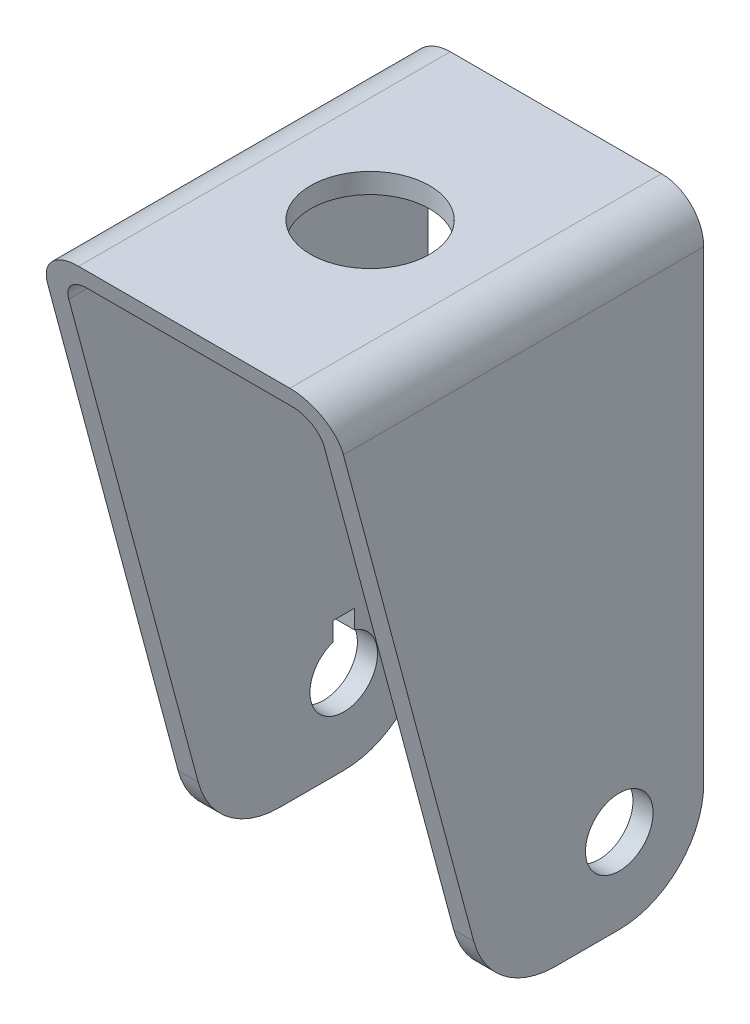
ISO-10303-21;
HEADER;
FILE_DESCRIPTION(('STEP AP214'),'2;1');
FILE_NAME('part.step','',(''),(''),'','','');
FILE_SCHEMA(('AUTOMOTIVE_DESIGN { 1 0 10303 214 1 1 1 1 }'));
ENDSEC;
DATA;
#1=APPLICATION_CONTEXT('core data for automotive mechanical design processes');
#2=APPLICATION_PROTOCOL_DEFINITION('international standard','automotive_design',2000,#1);
#3=PRODUCT_CONTEXT('',#1,'mechanical');
#4=PRODUCT('Part','Part','',(#3));
#5=PRODUCT_RELATED_PRODUCT_CATEGORY('part','',(#4));
#6=PRODUCT_DEFINITION_FORMATION('','',#4);
#7=PRODUCT_DEFINITION_CONTEXT('part definition',#1,'design');
#8=PRODUCT_DEFINITION('design','',#6,#7);
#9=PRODUCT_DEFINITION_SHAPE('','',#8);
#10=(LENGTH_UNIT() NAMED_UNIT(*) SI_UNIT(.MILLI.,.METRE.));
#11=(NAMED_UNIT(*) PLANE_ANGLE_UNIT() SI_UNIT($,.RADIAN.));
#12=(NAMED_UNIT(*) SI_UNIT($,.STERADIAN.) SOLID_ANGLE_UNIT());
#13=UNCERTAINTY_MEASURE_WITH_UNIT(LENGTH_MEASURE(1.E-05),#10,'distance_accuracy_value','');
#14=(GEOMETRIC_REPRESENTATION_CONTEXT(3) GLOBAL_UNCERTAINTY_ASSIGNED_CONTEXT((#13)) GLOBAL_UNIT_ASSIGNED_CONTEXT((#10,
#11,#12)) REPRESENTATION_CONTEXT('',''));
#15=CARTESIAN_POINT('',(0.,0.,0.));
#16=DIRECTION('',(0.,0.,1.));
#17=DIRECTION('',(1.,0.,0.));
#18=AXIS2_PLACEMENT_3D('',#15,#16,#17);
#19=CARTESIAN_POINT('',(0.,-60.,-4.42971334996849));
#20=DIRECTION('',(1.,0.,0.));
#21=DIRECTION('',(0.,0.,-1.));
#22=AXIS2_PLACEMENT_3D('',#19,#20,#21);
#23=CYLINDRICAL_SURFACE('',#22,10.);
#24=DIRECTION('',(1.,0.,0.));
#25=VECTOR('',#24,1.);
#26=CARTESIAN_POINT('',(0.,-62.5881904510252,5.22954491292219));
#27=LINE('',#26,#25);
#28=CARTESIAN_POINT('',(15.12,-62.5881904510252,5.22954491292219));
#29=VERTEX_POINT('',#28);
#30=CARTESIAN_POINT('',(17.5,-62.5881904510252,5.22954491292219));
#31=VERTEX_POINT('',#30);
#32=EDGE_CURVE('E324',#29,#31,#27,.T.);
#33=ORIENTED_EDGE('',*,*,#32,.F.);
#34=CARTESIAN_POINT('',(15.12,-60.,-4.42971334996849));
#35=DIRECTION('',(1.,0.,0.));
#36=DIRECTION('',(0.,0.,-1.));
#37=AXIS2_PLACEMENT_3D('',#34,#35,#36);
#38=CIRCLE('',#37,10.);
#39=CARTESIAN_POINT('',(15.12,-70.,-4.42971334996849));
#40=VERTEX_POINT('',#39);
#41=EDGE_CURVE('E42',#40,#29,#38,.F.);
#42=ORIENTED_EDGE('',*,*,#41,.F.);
#43=DIRECTION('',(1.,0.,0.));
#44=VECTOR('',#43,1.);
#45=CARTESIAN_POINT('',(17.5,-70.,-4.42971334996849));
#46=LINE('',#45,#44);
#47=CARTESIAN_POINT('',(17.5,-70.,-4.42971334996849));
#48=VERTEX_POINT('',#47);
#49=EDGE_CURVE('E327',#48,#40,#46,.F.);
#50=ORIENTED_EDGE('',*,*,#49,.F.);
#51=CARTESIAN_POINT('',(17.5,-60.,-4.42971334996849));
#52=DIRECTION('',(-1.,0.,0.));
#53=DIRECTION('',(0.,-1.,0.));
#54=AXIS2_PLACEMENT_3D('',#51,#52,#53);
#55=CIRCLE('',#54,10.);
#56=EDGE_CURVE('E11',#31,#48,#55,.F.);
#57=ORIENTED_EDGE('',*,*,#56,.F.);
#58=EDGE_LOOP('',(#33,#42,#50,#57));
#59=FACE_BOUND('',#58,.T.);
#60=ADVANCED_FACE('F35',(#59),#23,.T.);
#61=CARTESIAN_POINT('',(12.5,-60.,-12.));
#62=DIRECTION('',(1.,0.,0.));
#63=DIRECTION('',(0.,0.,-1.));
#64=AXIS2_PLACEMENT_3D('',#61,#62,#63);
#65=CYLINDRICAL_SURFACE('',#64,10.);
#66=DIRECTION('',(-1.,0.,0.));
#67=VECTOR('',#66,1.);
#68=CARTESIAN_POINT('',(12.5,-60.,-22.));
#69=LINE('',#68,#67);
#70=CARTESIAN_POINT('',(17.5,-60.,-22.));
#71=VERTEX_POINT('',#70);
#72=CARTESIAN_POINT('',(15.12,-60.,-22.));
#73=VERTEX_POINT('',#72);
#74=EDGE_CURVE('E313',#71,#73,#69,.T.);
#75=ORIENTED_EDGE('',*,*,#74,.F.);
#76=CARTESIAN_POINT('',(17.5,-60.,-12.));
#77=DIRECTION('',(-1.,0.,0.));
#78=DIRECTION('',(0.,-1.,0.));
#79=AXIS2_PLACEMENT_3D('',#76,#77,#78);
#80=CIRCLE('',#79,10.);
#81=CARTESIAN_POINT('',(17.5,-70.,-12.));
#82=VERTEX_POINT('',#81);
#83=EDGE_CURVE('E319',#82,#71,#80,.F.);
#84=ORIENTED_EDGE('',*,*,#83,.F.);
#85=DIRECTION('',(-1.,0.,0.));
#86=VECTOR('',#85,1.);
#87=CARTESIAN_POINT('',(12.5,-70.,-12.));
#88=LINE('',#87,#86);
#89=CARTESIAN_POINT('',(15.12,-70.,-12.));
#90=VERTEX_POINT('',#89);
#91=EDGE_CURVE('E316',#90,#82,#88,.F.);
#92=ORIENTED_EDGE('',*,*,#91,.F.);
#93=CARTESIAN_POINT('',(15.12,-60.,-12.));
#94=DIRECTION('',(1.,0.,0.));
#95=DIRECTION('',(0.,0.,-1.));
#96=AXIS2_PLACEMENT_3D('',#93,#94,#95);
#97=CIRCLE('',#96,10.);
#98=EDGE_CURVE('E321',#73,#90,#97,.F.);
#99=ORIENTED_EDGE('',*,*,#98,.F.);
#100=EDGE_LOOP('',(#75,#84,#92,#99));
#101=FACE_BOUND('',#100,.T.);
#102=ADVANCED_FACE('F352',(#101),#65,.T.);
#103=CARTESIAN_POINT('',(12.12,-2.38,22.));
#104=DIRECTION('',(0.,1.,0.));
#105=DIRECTION('',(-1.,0.,0.));
#106=AXIS2_PLACEMENT_3D('',#103,#104,#105);
#107=PLANE('',#106);
#108=CARTESIAN_POINT('',(0.,-2.38000000000001,0.));
#109=DIRECTION('',(0.,1.,0.));
#110=DIRECTION('',(-1.,0.,0.));
#111=AXIS2_PLACEMENT_3D('',#108,#109,#110);
#112=CIRCLE('',#111,7.05);
#113=CARTESIAN_POINT('',(-7.05,-2.38000000000001,0.));
#114=VERTEX_POINT('',#113);
#115=EDGE_CURVE('E195',#114,#114,#112,.T.);
#116=ORIENTED_EDGE('',*,*,#115,.T.);
#117=EDGE_LOOP('',(#116));
#118=FACE_BOUND('',#117,.T.);
#119=DIRECTION('',(0.,0.,-1.));
#120=VECTOR('',#119,1.);
#121=CARTESIAN_POINT('',(12.12,-2.38,22.));
#122=LINE('',#121,#120);
#123=CARTESIAN_POINT('',(12.12,-2.38,21.3622809220139));
#124=VERTEX_POINT('',#123);
#125=CARTESIAN_POINT('',(12.12,-2.38,-22.));
#126=VERTEX_POINT('',#125);
#127=EDGE_CURVE('E311',#124,#126,#122,.T.);
#128=ORIENTED_EDGE('',*,*,#127,.F.);
#129=DIRECTION('',(-1.,0.,0.));
#130=VECTOR('',#129,1.);
#131=CARTESIAN_POINT('',(12.12,-2.38,21.3622809220139));
#132=LINE('',#131,#130);
#133=CARTESIAN_POINT('',(-12.12,-2.38,21.3622809220139));
#134=VERTEX_POINT('',#133);
#135=EDGE_CURVE('E280',#124,#134,#132,.T.);
#136=ORIENTED_EDGE('',*,*,#135,.T.);
#137=DIRECTION('',(0.,0.,-1.));
#138=VECTOR('',#137,1.);
#139=CARTESIAN_POINT('',(-12.12,-2.38,22.));
#140=LINE('',#139,#138);
#141=CARTESIAN_POINT('',(-12.12,-2.38,-22.));
#142=VERTEX_POINT('',#141);
#143=EDGE_CURVE('E237',#134,#142,#140,.T.);
#144=ORIENTED_EDGE('',*,*,#143,.T.);
#145=DIRECTION('',(1.,0.,0.));
#146=VECTOR('',#145,1.);
#147=CARTESIAN_POINT('',(12.12,-2.38,-22.));
#148=LINE('',#147,#146);
#149=EDGE_CURVE('E282',#142,#126,#148,.T.);
#150=ORIENTED_EDGE('',*,*,#149,.T.);
#151=EDGE_LOOP('',(#128,#136,#144,#150));
#152=FACE_BOUND('',#151,.T.);
#153=ADVANCED_FACE('F387',(#118,#152),#107,.F.);
#154=CARTESIAN_POINT('',(12.12,-5.38,22.));
#155=DIRECTION('',(0.,0.,-1.));
#156=DIRECTION('',(-1.,0.,0.));
#157=AXIS2_PLACEMENT_3D('',#154,#155,#156);
#158=CYLINDRICAL_SURFACE('',#157,3.);
#159=DIRECTION('',(0.,0.,-1.));
#160=VECTOR('',#159,1.);
#161=CARTESIAN_POINT('',(15.12,-5.38000000000002,22.));
#162=LINE('',#161,#160);
#163=CARTESIAN_POINT('',(15.12,-5.38000000000003,20.5584333447205));
#164=VERTEX_POINT('',#163);
#165=CARTESIAN_POINT('',(15.12,-5.38000000000002,-22.));
#166=VERTEX_POINT('',#165);
#167=EDGE_CURVE('E309',#164,#166,#162,.T.);
#168=ORIENTED_EDGE('',*,*,#167,.F.);
#169=CARTESIAN_POINT('',(12.12,-5.38,20.5584333447205));
#170=DIRECTION('',(0.,0.258819045102525,-0.965925826289067));
#171=DIRECTION('',(0.,-0.965925826289067,-0.258819045102525));
#172=AXIS2_PLACEMENT_3D('',#169,#170,#171);
#173=ELLIPSE('',#172,3.10582854123025,3.);
#174=EDGE_CURVE('E277',#164,#124,#173,.F.);
#175=ORIENTED_EDGE('',*,*,#174,.T.);
#176=ORIENTED_EDGE('',*,*,#127,.T.);
#177=CARTESIAN_POINT('',(12.12,-5.38,-22.));
#178=DIRECTION('',(0.,0.,-1.));
#179=DIRECTION('',(1.,0.,0.));
#180=AXIS2_PLACEMENT_3D('',#177,#178,#179);
#181=CIRCLE('',#180,3.);
#182=EDGE_CURVE('E289',#126,#166,#181,.T.);
#183=ORIENTED_EDGE('',*,*,#182,.T.);
#184=EDGE_LOOP('',(#168,#175,#176,#183));
#185=FACE_BOUND('',#184,.T.);
#186=ADVANCED_FACE('F341',(#185),#158,.F.);
#187=CARTESIAN_POINT('',(15.12,-70.,22.));
#188=DIRECTION('',(1.,0.,0.));
#189=DIRECTION('',(0.,0.,-1.));
#190=AXIS2_PLACEMENT_3D('',#187,#188,#189);
#191=PLANE('',#190);
#192=CARTESIAN_POINT('',(15.12,-60.,-12.));
#193=DIRECTION('',(1.,0.,0.));
#194=DIRECTION('',(0.,0.,-1.));
#195=AXIS2_PLACEMENT_3D('',#192,#193,#194);
#196=CIRCLE('',#195,4.);
#197=CARTESIAN_POINT('',(15.12,-60.,-16.));
#198=VERTEX_POINT('',#197);
#199=EDGE_CURVE('E267',#198,#198,#196,.T.);
#200=ORIENTED_EDGE('',*,*,#199,.T.);
#201=EDGE_LOOP('',(#200));
#202=FACE_BOUND('',#201,.T.);
#203=DIRECTION('',(0.,0.,-1.));
#204=VECTOR('',#203,1.);
#205=CARTESIAN_POINT('',(15.12,-70.,22.));
#206=LINE('',#205,#204);
#207=EDGE_CURVE('E307',#40,#90,#206,.T.);
#208=ORIENTED_EDGE('',*,*,#207,.F.);
#209=ORIENTED_EDGE('',*,*,#41,.T.);
#210=DIRECTION('',(0.,0.965925826289067,0.258819045102525));
#211=VECTOR('',#210,1.);
#212=CARTESIAN_POINT('',(15.12,-65.3108891324552,4.49999999999973));
#213=LINE('',#212,#211);
#214=EDGE_CURVE('E275',#29,#164,#213,.T.);
#215=ORIENTED_EDGE('',*,*,#214,.T.);
#216=ORIENTED_EDGE('',*,*,#167,.T.);
#217=DIRECTION('',(0.,-1.,0.));
#218=VECTOR('',#217,1.);
#219=CARTESIAN_POINT('',(15.12,-70.,-22.));
#220=LINE('',#219,#218);
#221=EDGE_CURVE('E292',#166,#73,#220,.T.);
#222=ORIENTED_EDGE('',*,*,#221,.T.);
#223=ORIENTED_EDGE('',*,*,#98,.T.);
#224=EDGE_LOOP('',(#208,#209,#215,#216,#222,#223));
#225=FACE_BOUND('',#224,.T.);
#226=ADVANCED_FACE('F332',(#202,#225),#191,.F.);
#227=CARTESIAN_POINT('',(17.5,-70.,22.));
#228=DIRECTION('',(0.,1.,0.));
#229=DIRECTION('',(0.,0.,1.));
#230=AXIS2_PLACEMENT_3D('',#227,#228,#229);
#231=PLANE('',#230);
#232=DIRECTION('',(0.,0.,-1.));
#233=VECTOR('',#232,1.);
#234=CARTESIAN_POINT('',(17.5,-70.,22.));
#235=LINE('',#234,#233);
#236=EDGE_CURVE('E305',#48,#82,#235,.T.);
#237=ORIENTED_EDGE('',*,*,#236,.F.);
#238=ORIENTED_EDGE('',*,*,#49,.T.);
#239=ORIENTED_EDGE('',*,*,#207,.T.);
#240=ORIENTED_EDGE('',*,*,#91,.T.);
#241=EDGE_LOOP('',(#237,#238,#239,#240));
#242=FACE_BOUND('',#241,.T.);
#243=ADVANCED_FACE('F355',(#242),#231,.F.);
#244=CARTESIAN_POINT('',(17.5,-5.00000000000003,22.));
#245=DIRECTION('',(-1.,0.,0.));
#246=DIRECTION('',(0.,-1.,0.));
#247=AXIS2_PLACEMENT_3D('',#244,#245,#246);
#248=PLANE('',#247);
#249=CARTESIAN_POINT('',(17.5,-60.,-12.));
#250=DIRECTION('',(1.,0.,0.));
#251=DIRECTION('',(0.,1.,0.));
#252=AXIS2_PLACEMENT_3D('',#249,#250,#251);
#253=CIRCLE('',#252,4.);
#254=CARTESIAN_POINT('',(17.5,-56.,-12.));
#255=VERTEX_POINT('',#254);
#256=EDGE_CURVE('E264',#255,#255,#253,.T.);
#257=ORIENTED_EDGE('',*,*,#256,.F.);
#258=EDGE_LOOP('',(#257));
#259=FACE_BOUND('',#258,.T.);
#260=DIRECTION('',(0.,0.965925826289067,0.258819045102525));
#261=VECTOR('',#260,1.);
#262=CARTESIAN_POINT('',(17.5,-70.,3.24355652982108));
#263=LINE('',#262,#261);
#264=CARTESIAN_POINT('',(17.5,-5.00000000000001,20.6602540378444));
#265=VERTEX_POINT('',#264);
#266=EDGE_CURVE('E270',#31,#265,#263,.T.);
#267=ORIENTED_EDGE('',*,*,#266,.F.);
#268=ORIENTED_EDGE('',*,*,#56,.T.);
#269=ORIENTED_EDGE('',*,*,#236,.T.);
#270=ORIENTED_EDGE('',*,*,#83,.T.);
#271=DIRECTION('',(0.,1.,0.));
#272=VECTOR('',#271,1.);
#273=CARTESIAN_POINT('',(17.5,-5.00000000000003,-22.));
#274=LINE('',#273,#272);
#275=CARTESIAN_POINT('',(17.5,-5.00000000000003,-22.));
#276=VERTEX_POINT('',#275);
#277=EDGE_CURVE('E295',#71,#276,#274,.T.);
#278=ORIENTED_EDGE('',*,*,#277,.T.);
#279=DIRECTION('',(0.,0.,-1.));
#280=VECTOR('',#279,1.);
#281=CARTESIAN_POINT('',(17.5,-5.00000000000003,22.));
#282=LINE('',#281,#280);
#283=EDGE_CURVE('E302',#265,#276,#282,.T.);
#284=ORIENTED_EDGE('',*,*,#283,.F.);
#285=EDGE_LOOP('',(#267,#268,#269,#270,#278,#284));
#286=FACE_BOUND('',#285,.T.);
#287=ADVANCED_FACE('F356',(#259,#286),#248,.F.);
#288=CARTESIAN_POINT('',(12.5,-5.,22.));
#289=DIRECTION('',(0.,0.,-1.));
#290=DIRECTION('',(-1.,0.,0.));
#291=AXIS2_PLACEMENT_3D('',#288,#289,#290);
#292=CYLINDRICAL_SURFACE('',#291,5.);
#293=DIRECTION('',(0.,0.,-1.));
#294=VECTOR('',#293,1.);
#295=CARTESIAN_POINT('',(12.5,0.,22.));
#296=LINE('',#295,#294);
#297=CARTESIAN_POINT('',(12.5,0.,22.));
#298=VERTEX_POINT('',#297);
#299=CARTESIAN_POINT('',(12.5,0.,-22.));
#300=VERTEX_POINT('',#299);
#301=EDGE_CURVE('E285',#298,#300,#296,.T.);
#302=ORIENTED_EDGE('',*,*,#301,.F.);
#303=CARTESIAN_POINT('',(12.5,-5.,20.6602540378444));
#304=DIRECTION('',(0.,0.258819045102525,-0.965925826289067));
#305=DIRECTION('',(0.,-0.965925826289067,-0.258819045102525));
#306=AXIS2_PLACEMENT_3D('',#303,#304,#305);
#307=ELLIPSE('',#306,5.17638090205042,5.);
#308=EDGE_CURVE('E272',#298,#265,#307,.T.);
#309=ORIENTED_EDGE('',*,*,#308,.T.);
#310=ORIENTED_EDGE('',*,*,#283,.T.);
#311=CARTESIAN_POINT('',(12.5,-5.,-22.));
#312=DIRECTION('',(0.,0.,1.));
#313=DIRECTION('',(-1.,0.,0.));
#314=AXIS2_PLACEMENT_3D('',#311,#312,#313);
#315=CIRCLE('',#314,5.);
#316=EDGE_CURVE('E297',#276,#300,#315,.T.);
#317=ORIENTED_EDGE('',*,*,#316,.T.);
#318=EDGE_LOOP('',(#302,#309,#310,#317));
#319=FACE_BOUND('',#318,.T.);
#320=ADVANCED_FACE('F360',(#319),#292,.T.);
#321=CARTESIAN_POINT('',(0.,0.,22.));
#322=DIRECTION('',(0.,-1.,0.));
#323=DIRECTION('',(0.,0.,-1.));
#324=AXIS2_PLACEMENT_3D('',#321,#322,#323);
#325=PLANE('',#324);
#326=CARTESIAN_POINT('',(0.,0.,0.));
#327=DIRECTION('',(0.,1.,0.));
#328=DIRECTION('',(0.,0.,1.));
#329=AXIS2_PLACEMENT_3D('',#326,#327,#328);
#330=CIRCLE('',#329,7.05);
#331=CARTESIAN_POINT('',(0.,0.,7.05));
#332=VERTEX_POINT('',#331);
#333=EDGE_CURVE('E200',#332,#332,#330,.T.);
#334=ORIENTED_EDGE('',*,*,#333,.F.);
#335=EDGE_LOOP('',(#334));
#336=FACE_BOUND('',#335,.T.);
#337=DIRECTION('',(-1.,0.,0.));
#338=VECTOR('',#337,1.);
#339=CARTESIAN_POINT('',(0.,0.,-22.));
#340=LINE('',#339,#338);
#341=CARTESIAN_POINT('',(-12.5,0.,-22.));
#342=VERTEX_POINT('',#341);
#343=EDGE_CURVE('E286',#300,#342,#340,.T.);
#344=ORIENTED_EDGE('',*,*,#343,.T.);
#345=DIRECTION('',(0.,0.,-1.));
#346=VECTOR('',#345,1.);
#347=CARTESIAN_POINT('',(-12.5,0.,22.));
#348=LINE('',#347,#346);
#349=CARTESIAN_POINT('',(-12.5,0.,22.));
#350=VERTEX_POINT('',#349);
#351=EDGE_CURVE('E224',#350,#342,#348,.T.);
#352=ORIENTED_EDGE('',*,*,#351,.F.);
#353=DIRECTION('',(-1.,0.,0.));
#354=VECTOR('',#353,1.);
#355=CARTESIAN_POINT('',(0.,0.,22.));
#356=LINE('',#355,#354);
#357=EDGE_CURVE('E283',#298,#350,#356,.T.);
#358=ORIENTED_EDGE('',*,*,#357,.F.);
#359=ORIENTED_EDGE('',*,*,#301,.T.);
#360=EDGE_LOOP('',(#344,#352,#358,#359));
#361=FACE_BOUND('',#360,.T.);
#362=ADVANCED_FACE('F364',(#336,#361),#325,.F.);
#363=CARTESIAN_POINT('',(12.5,-5.,-22.));
#364=DIRECTION('',(0.,0.,-1.));
#365=DIRECTION('',(-1.,0.,0.));
#366=AXIS2_PLACEMENT_3D('',#363,#364,#365);
#367=PLANE('',#366);
#368=ORIENTED_EDGE('',*,*,#277,.F.);
#369=ORIENTED_EDGE('',*,*,#74,.T.);
#370=ORIENTED_EDGE('',*,*,#221,.F.);
#371=ORIENTED_EDGE('',*,*,#182,.F.);
#372=ORIENTED_EDGE('',*,*,#149,.F.);
#373=CARTESIAN_POINT('',(-12.12,-5.38,-22.));
#374=DIRECTION('',(0.,0.,1.));
#375=DIRECTION('',(-1.,0.,0.));
#376=AXIS2_PLACEMENT_3D('',#373,#374,#375);
#377=CIRCLE('',#376,3.);
#378=CARTESIAN_POINT('',(-15.12,-5.38000000000002,-22.));
#379=VERTEX_POINT('',#378);
#380=EDGE_CURVE('E213',#142,#379,#377,.T.);
#381=ORIENTED_EDGE('',*,*,#380,.T.);
#382=DIRECTION('',(0.,-1.,0.));
#383=VECTOR('',#382,1.);
#384=CARTESIAN_POINT('',(-15.12,-70.,-22.));
#385=LINE('',#384,#383);
#386=CARTESIAN_POINT('',(-15.12,-60.,-22.));
#387=VERTEX_POINT('',#386);
#388=EDGE_CURVE('E216',#379,#387,#385,.T.);
#389=ORIENTED_EDGE('',*,*,#388,.T.);
#390=DIRECTION('',(1.,0.,0.));
#391=VECTOR('',#390,1.);
#392=CARTESIAN_POINT('',(-12.5,-60.,-22.));
#393=LINE('',#392,#391);
#394=CARTESIAN_POINT('',(-17.5,-60.,-22.));
#395=VERTEX_POINT('',#394);
#396=EDGE_CURVE('E240',#395,#387,#393,.T.);
#397=ORIENTED_EDGE('',*,*,#396,.F.);
#398=DIRECTION('',(0.,1.,0.));
#399=VECTOR('',#398,1.);
#400=CARTESIAN_POINT('',(-17.5,-5.00000000000003,-22.));
#401=LINE('',#400,#399);
#402=CARTESIAN_POINT('',(-17.5,-5.00000000000003,-22.));
#403=VERTEX_POINT('',#402);
#404=EDGE_CURVE('E218',#395,#403,#401,.T.);
#405=ORIENTED_EDGE('',*,*,#404,.T.);
#406=CARTESIAN_POINT('',(-12.5,-5.,-22.));
#407=DIRECTION('',(0.,0.,-1.));
#408=DIRECTION('',(1.,0.,0.));
#409=AXIS2_PLACEMENT_3D('',#406,#407,#408);
#410=CIRCLE('',#409,5.);
#411=EDGE_CURVE('E221',#403,#342,#410,.T.);
#412=ORIENTED_EDGE('',*,*,#411,.T.);
#413=ORIENTED_EDGE('',*,*,#343,.F.);
#414=ORIENTED_EDGE('',*,*,#316,.F.);
#415=EDGE_LOOP('',(#368,#369,#370,#371,#372,#381,#389,#397,#405,#412,#413,#414));
#416=FACE_BOUND('',#415,.T.);
#417=ADVANCED_FACE('F347',(#416),#367,.T.);
#418=CARTESIAN_POINT('',(0.,-70.,3.24355652982108));
#419=DIRECTION('',(0.,0.258819045102525,-0.965925826289067));
#420=DIRECTION('',(0.,0.965925826289067,0.258819045102525));
#421=AXIS2_PLACEMENT_3D('',#418,#419,#420);
#422=PLANE('',#421);
#423=ORIENTED_EDGE('',*,*,#214,.F.);
#424=ORIENTED_EDGE('',*,*,#32,.T.);
#425=ORIENTED_EDGE('',*,*,#266,.T.);
#426=ORIENTED_EDGE('',*,*,#308,.F.);
#427=ORIENTED_EDGE('',*,*,#357,.T.);
#428=CARTESIAN_POINT('',(-12.5,-5.,20.6602540378444));
#429=DIRECTION('',(0.,-0.258819045102525,0.965925826289067));
#430=DIRECTION('',(0.,-0.965925826289067,-0.258819045102525));
#431=AXIS2_PLACEMENT_3D('',#428,#429,#430);
#432=ELLIPSE('',#431,5.17638090205042,5.);
#433=CARTESIAN_POINT('',(-17.5,-5.00000000000001,20.6602540378444));
#434=VERTEX_POINT('',#433);
#435=EDGE_CURVE('E206',#350,#434,#432,.T.);
#436=ORIENTED_EDGE('',*,*,#435,.T.);
#437=DIRECTION('',(0.,0.965925826289067,0.258819045102525));
#438=VECTOR('',#437,1.);
#439=CARTESIAN_POINT('',(-17.5,-70.,3.24355652982108));
#440=LINE('',#439,#438);
#441=CARTESIAN_POINT('',(-17.5,-62.5881904510252,5.22954491292219));
#442=VERTEX_POINT('',#441);
#443=EDGE_CURVE('E197',#442,#434,#440,.T.);
#444=ORIENTED_EDGE('',*,*,#443,.F.);
#445=DIRECTION('',(-1.,0.,0.));
#446=VECTOR('',#445,1.);
#447=CARTESIAN_POINT('',(0.,-62.5881904510252,5.22954491292219));
#448=LINE('',#447,#446);
#449=CARTESIAN_POINT('',(-15.12,-62.5881904510252,5.22954491292219));
#450=VERTEX_POINT('',#449);
#451=EDGE_CURVE('E252',#450,#442,#448,.T.);
#452=ORIENTED_EDGE('',*,*,#451,.F.);
#453=DIRECTION('',(0.,0.965925826289067,0.258819045102525));
#454=VECTOR('',#453,1.);
#455=CARTESIAN_POINT('',(-15.12,-65.3108891324552,4.49999999999973));
#456=LINE('',#455,#454);
#457=CARTESIAN_POINT('',(-15.12,-5.38000000000003,20.5584333447205));
#458=VERTEX_POINT('',#457);
#459=EDGE_CURVE('E208',#450,#458,#456,.T.);
#460=ORIENTED_EDGE('',*,*,#459,.T.);
#461=CARTESIAN_POINT('',(-12.12,-5.38,20.5584333447205));
#462=DIRECTION('',(0.,-0.258819045102525,0.965925826289067));
#463=DIRECTION('',(0.,-0.965925826289067,-0.258819045102525));
#464=AXIS2_PLACEMENT_3D('',#461,#462,#463);
#465=ELLIPSE('',#464,3.10582854123025,3.);
#466=EDGE_CURVE('E210',#458,#134,#465,.F.);
#467=ORIENTED_EDGE('',*,*,#466,.T.);
#468=ORIENTED_EDGE('',*,*,#135,.F.);
#469=ORIENTED_EDGE('',*,*,#174,.F.);
#470=EDGE_LOOP('',(#423,#424,#425,#426,#427,#436,#444,#452,#460,#467,#468,#469));
#471=FACE_BOUND('',#470,.T.);
#472=ADVANCED_FACE('F337',(#471),#422,.F.);
#473=CARTESIAN_POINT('',(0.,-60.,-12.));
#474=DIRECTION('',(1.,0.,0.));
#475=DIRECTION('',(0.,1.,0.));
#476=AXIS2_PLACEMENT_3D('',#473,#474,#475);
#477=CYLINDRICAL_SURFACE('',#476,4.);
#478=ORIENTED_EDGE('',*,*,#256,.T.);
#479=EDGE_LOOP('',(#478));
#480=FACE_BOUND('',#479,.T.);
#481=ORIENTED_EDGE('',*,*,#199,.F.);
#482=EDGE_LOOP('',(#481));
#483=FACE_BOUND('',#482,.T.);
#484=ADVANCED_FACE('F438',(#480,#483),#477,.F.);
#485=CARTESIAN_POINT('',(0.,-60.,-4.42971334996849));
#486=DIRECTION('',(-1.,0.,0.));
#487=DIRECTION('',(0.,0.,-1.));
#488=AXIS2_PLACEMENT_3D('',#485,#486,#487);
#489=CYLINDRICAL_SURFACE('',#488,10.);
#490=ORIENTED_EDGE('',*,*,#451,.T.);
#491=CARTESIAN_POINT('',(-17.5,-60.,-4.42971334996849));
#492=DIRECTION('',(-1.,0.,0.));
#493=DIRECTION('',(0.,-1.,0.));
#494=AXIS2_PLACEMENT_3D('',#491,#492,#493);
#495=CIRCLE('',#494,10.);
#496=CARTESIAN_POINT('',(-17.5,-70.,-4.42971334996849));
#497=VERTEX_POINT('',#496);
#498=EDGE_CURVE('E261',#442,#497,#495,.F.);
#499=ORIENTED_EDGE('',*,*,#498,.T.);
#500=DIRECTION('',(-1.,0.,0.));
#501=VECTOR('',#500,1.);
#502=CARTESIAN_POINT('',(-17.5,-70.,-4.42971334996849));
#503=LINE('',#502,#501);
#504=CARTESIAN_POINT('',(-15.12,-70.,-4.42971334996849));
#505=VERTEX_POINT('',#504);
#506=EDGE_CURVE('E255',#497,#505,#503,.F.);
#507=ORIENTED_EDGE('',*,*,#506,.T.);
#508=CARTESIAN_POINT('',(-15.12,-60.,-4.42971334996849));
#509=DIRECTION('',(1.,0.,0.));
#510=DIRECTION('',(0.,0.,-1.));
#511=AXIS2_PLACEMENT_3D('',#508,#509,#510);
#512=CIRCLE('',#511,10.);
#513=EDGE_CURVE('E258',#505,#450,#512,.F.);
#514=ORIENTED_EDGE('',*,*,#513,.T.);
#515=EDGE_LOOP('',(#490,#499,#507,#514));
#516=FACE_BOUND('',#515,.T.);
#517=ADVANCED_FACE('F374',(#516),#489,.T.);
#518=CARTESIAN_POINT('',(-12.5,-60.,-12.));
#519=DIRECTION('',(-1.,0.,0.));
#520=DIRECTION('',(0.,0.,-1.));
#521=AXIS2_PLACEMENT_3D('',#518,#519,#520);
#522=CYLINDRICAL_SURFACE('',#521,10.);
#523=ORIENTED_EDGE('',*,*,#396,.T.);
#524=CARTESIAN_POINT('',(-15.12,-60.,-12.));
#525=DIRECTION('',(1.,0.,0.));
#526=DIRECTION('',(0.,0.,-1.));
#527=AXIS2_PLACEMENT_3D('',#524,#525,#526);
#528=CIRCLE('',#527,10.);
#529=CARTESIAN_POINT('',(-15.12,-70.,-12.));
#530=VERTEX_POINT('',#529);
#531=EDGE_CURVE('E249',#387,#530,#528,.F.);
#532=ORIENTED_EDGE('',*,*,#531,.T.);
#533=DIRECTION('',(1.,0.,0.));
#534=VECTOR('',#533,1.);
#535=CARTESIAN_POINT('',(-12.5,-70.,-12.));
#536=LINE('',#535,#534);
#537=CARTESIAN_POINT('',(-17.5,-70.,-12.));
#538=VERTEX_POINT('',#537);
#539=EDGE_CURVE('E243',#530,#538,#536,.F.);
#540=ORIENTED_EDGE('',*,*,#539,.T.);
#541=CARTESIAN_POINT('',(-17.5,-60.,-12.));
#542=DIRECTION('',(-1.,0.,0.));
#543=DIRECTION('',(0.,-1.,0.));
#544=AXIS2_PLACEMENT_3D('',#541,#542,#543);
#545=CIRCLE('',#544,10.);
#546=EDGE_CURVE('E246',#538,#395,#545,.F.);
#547=ORIENTED_EDGE('',*,*,#546,.T.);
#548=EDGE_LOOP('',(#523,#532,#540,#547));
#549=FACE_BOUND('',#548,.T.);
#550=ADVANCED_FACE('F390',(#549),#522,.T.);
#551=CARTESIAN_POINT('',(-12.12,-5.38,22.));
#552=DIRECTION('',(0.,0.,-1.));
#553=DIRECTION('',(1.,0.,0.));
#554=AXIS2_PLACEMENT_3D('',#551,#552,#553);
#555=CYLINDRICAL_SURFACE('',#554,3.);
#556=DIRECTION('',(0.,0.,-1.));
#557=VECTOR('',#556,1.);
#558=CARTESIAN_POINT('',(-15.12,-5.38000000000002,22.));
#559=LINE('',#558,#557);
#560=EDGE_CURVE('E234',#458,#379,#559,.T.);
#561=ORIENTED_EDGE('',*,*,#560,.T.);
#562=ORIENTED_EDGE('',*,*,#380,.F.);
#563=ORIENTED_EDGE('',*,*,#143,.F.);
#564=ORIENTED_EDGE('',*,*,#466,.F.);
#565=EDGE_LOOP('',(#561,#562,#563,#564));
#566=FACE_BOUND('',#565,.T.);
#567=ADVANCED_FACE('F384',(#566),#555,.F.);
#568=CARTESIAN_POINT('',(-15.12,-70.,22.));
#569=DIRECTION('',(-1.,0.,0.));
#570=DIRECTION('',(0.,0.,-1.));
#571=AXIS2_PLACEMENT_3D('',#568,#569,#570);
#572=PLANE('',#571);
#573=DIRECTION('',(0.,0.,1.));
#574=VECTOR('',#573,1.);
#575=CARTESIAN_POINT('',(-15.12,-54.,-13.25));
#576=LINE('',#575,#574);
#577=CARTESIAN_POINT('',(-15.12,-54.,-13.25));
#578=VERTEX_POINT('',#577);
#579=CARTESIAN_POINT('',(-15.12,-54.,-10.75));
#580=VERTEX_POINT('',#579);
#581=EDGE_CURVE('E602',#578,#580,#576,.T.);
#582=ORIENTED_EDGE('',*,*,#581,.F.);
#583=DIRECTION('',(0.,1.,0.));
#584=VECTOR('',#583,1.);
#585=CARTESIAN_POINT('',(-15.12,-56.2003289616073,-13.25));
#586=LINE('',#585,#584);
#587=CARTESIAN_POINT('',(-15.12,-56.2003289616073,-13.25));
#588=VERTEX_POINT('',#587);
#589=EDGE_CURVE('E605',#588,#578,#586,.T.);
#590=ORIENTED_EDGE('',*,*,#589,.F.);
#591=CARTESIAN_POINT('',(-15.12,-60.,-12.));
#592=DIRECTION('',(1.,0.,0.));
#593=DIRECTION('',(0.,0.,-1.));
#594=AXIS2_PLACEMENT_3D('',#591,#592,#593);
#595=CIRCLE('',#594,4.);
#596=CARTESIAN_POINT('',(-15.12,-56.2003289616073,-10.75));
#597=VERTEX_POINT('',#596);
#598=EDGE_CURVE('E188',#597,#588,#595,.T.);
#599=ORIENTED_EDGE('',*,*,#598,.F.);
#600=DIRECTION('',(0.,-1.,0.));
#601=VECTOR('',#600,1.);
#602=CARTESIAN_POINT('',(-15.12,-56.2003289616073,-10.75));
#603=LINE('',#602,#601);
#604=EDGE_CURVE('E49',#580,#597,#603,.T.);
#605=ORIENTED_EDGE('',*,*,#604,.F.);
#606=EDGE_LOOP('',(#582,#590,#599,#605));
#607=FACE_BOUND('',#606,.T.);
#608=DIRECTION('',(0.,0.,-1.));
#609=VECTOR('',#608,1.);
#610=CARTESIAN_POINT('',(-15.12,-70.,22.));
#611=LINE('',#610,#609);
#612=EDGE_CURVE('E232',#505,#530,#611,.T.);
#613=ORIENTED_EDGE('',*,*,#612,.T.);
#614=ORIENTED_EDGE('',*,*,#531,.F.);
#615=ORIENTED_EDGE('',*,*,#388,.F.);
#616=ORIENTED_EDGE('',*,*,#560,.F.);
#617=ORIENTED_EDGE('',*,*,#459,.F.);
#618=ORIENTED_EDGE('',*,*,#513,.F.);
#619=EDGE_LOOP('',(#613,#614,#615,#616,#617,#618));
#620=FACE_BOUND('',#619,.T.);
#621=ADVANCED_FACE('F378',(#607,#620),#572,.F.);
#622=CARTESIAN_POINT('',(-17.5,-70.,22.));
#623=DIRECTION('',(0.,1.,0.));
#624=DIRECTION('',(0.,0.,1.));
#625=AXIS2_PLACEMENT_3D('',#622,#623,#624);
#626=PLANE('',#625);
#627=DIRECTION('',(0.,0.,-1.));
#628=VECTOR('',#627,1.);
#629=CARTESIAN_POINT('',(-17.5,-70.,22.));
#630=LINE('',#629,#628);
#631=EDGE_CURVE('E230',#497,#538,#630,.T.);
#632=ORIENTED_EDGE('',*,*,#631,.T.);
#633=ORIENTED_EDGE('',*,*,#539,.F.);
#634=ORIENTED_EDGE('',*,*,#612,.F.);
#635=ORIENTED_EDGE('',*,*,#506,.F.);
#636=EDGE_LOOP('',(#632,#633,#634,#635));
#637=FACE_BOUND('',#636,.T.);
#638=ADVANCED_FACE('F393',(#637),#626,.F.);
#639=CARTESIAN_POINT('',(-17.5,-5.00000000000003,22.));
#640=DIRECTION('',(1.,0.,0.));
#641=DIRECTION('',(0.,-1.,0.));
#642=AXIS2_PLACEMENT_3D('',#639,#640,#641);
#643=PLANE('',#642);
#644=CARTESIAN_POINT('',(-17.5,-60.,-12.));
#645=DIRECTION('',(1.,0.,0.));
#646=DIRECTION('',(0.,1.,0.));
#647=AXIS2_PLACEMENT_3D('',#644,#645,#646);
#648=CIRCLE('',#647,4.);
#649=CARTESIAN_POINT('',(-17.5,-56.2003289616073,-10.75));
#650=VERTEX_POINT('',#649);
#651=CARTESIAN_POINT('',(-17.5,-56.2003289616073,-13.25));
#652=VERTEX_POINT('',#651);
#653=EDGE_CURVE('E186',#650,#652,#648,.T.);
#654=ORIENTED_EDGE('',*,*,#653,.T.);
#655=DIRECTION('',(0.,-1.,0.));
#656=VECTOR('',#655,1.);
#657=CARTESIAN_POINT('',(-17.5,-56.2003289616073,-13.25));
#658=LINE('',#657,#656);
#659=CARTESIAN_POINT('',(-17.5,-54.,-13.25));
#660=VERTEX_POINT('',#659);
#661=EDGE_CURVE('E168',#660,#652,#658,.T.);
#662=ORIENTED_EDGE('',*,*,#661,.F.);
#663=DIRECTION('',(0.,0.,-1.));
#664=VECTOR('',#663,1.);
#665=CARTESIAN_POINT('',(-17.5,-54.,-13.25));
#666=LINE('',#665,#664);
#667=CARTESIAN_POINT('',(-17.5,-54.,-10.75));
#668=VERTEX_POINT('',#667);
#669=EDGE_CURVE('E180',#668,#660,#666,.T.);
#670=ORIENTED_EDGE('',*,*,#669,.F.);
#671=DIRECTION('',(0.,1.,0.));
#672=VECTOR('',#671,1.);
#673=CARTESIAN_POINT('',(-17.5,-56.2003289616073,-10.75));
#674=LINE('',#673,#672);
#675=EDGE_CURVE('E179',#650,#668,#674,.T.);
#676=ORIENTED_EDGE('',*,*,#675,.F.);
#677=EDGE_LOOP('',(#654,#662,#670,#676));
#678=FACE_BOUND('',#677,.T.);
#679=ORIENTED_EDGE('',*,*,#443,.T.);
#680=DIRECTION('',(0.,0.,-1.));
#681=VECTOR('',#680,1.);
#682=CARTESIAN_POINT('',(-17.5,-5.00000000000003,22.));
#683=LINE('',#682,#681);
#684=EDGE_CURVE('E227',#434,#403,#683,.T.);
#685=ORIENTED_EDGE('',*,*,#684,.T.);
#686=ORIENTED_EDGE('',*,*,#404,.F.);
#687=ORIENTED_EDGE('',*,*,#546,.F.);
#688=ORIENTED_EDGE('',*,*,#631,.F.);
#689=ORIENTED_EDGE('',*,*,#498,.F.);
#690=EDGE_LOOP('',(#679,#685,#686,#687,#688,#689));
#691=FACE_BOUND('',#690,.T.);
#692=ADVANCED_FACE('F192',(#678,#691),#643,.F.);
#693=CARTESIAN_POINT('',(-12.5,-5.,22.));
#694=DIRECTION('',(0.,0.,-1.));
#695=DIRECTION('',(1.,0.,0.));
#696=AXIS2_PLACEMENT_3D('',#693,#694,#695);
#697=CYLINDRICAL_SURFACE('',#696,5.);
#698=ORIENTED_EDGE('',*,*,#351,.T.);
#699=ORIENTED_EDGE('',*,*,#411,.F.);
#700=ORIENTED_EDGE('',*,*,#684,.F.);
#701=ORIENTED_EDGE('',*,*,#435,.F.);
#702=EDGE_LOOP('',(#698,#699,#700,#701));
#703=FACE_BOUND('',#702,.T.);
#704=ADVANCED_FACE('F369',(#703),#697,.T.);
#705=CARTESIAN_POINT('',(0.,-60.,-12.));
#706=DIRECTION('',(-1.,0.,0.));
#707=DIRECTION('',(0.,1.,0.));
#708=AXIS2_PLACEMENT_3D('',#705,#706,#707);
#709=CYLINDRICAL_SURFACE('',#708,4.);
#710=ORIENTED_EDGE('',*,*,#598,.T.);
#711=DIRECTION('',(-1.,0.,0.));
#712=VECTOR('',#711,1.);
#713=CARTESIAN_POINT('',(0.,-56.2003289616073,-13.25));
#714=LINE('',#713,#712);
#715=EDGE_CURVE('E172',#652,#588,#714,.F.);
#716=ORIENTED_EDGE('',*,*,#715,.F.);
#717=ORIENTED_EDGE('',*,*,#653,.F.);
#718=DIRECTION('',(-1.,0.,0.));
#719=VECTOR('',#718,1.);
#720=CARTESIAN_POINT('',(0.,-56.2003289616073,-10.75));
#721=LINE('',#720,#719);
#722=EDGE_CURVE('E189',#597,#650,#721,.T.);
#723=ORIENTED_EDGE('',*,*,#722,.F.);
#724=EDGE_LOOP('',(#710,#716,#717,#723));
#725=FACE_BOUND('',#724,.T.);
#726=ADVANCED_FACE('F185',(#725),#709,.F.);
#727=CARTESIAN_POINT('',(0.,-70.,0.));
#728=DIRECTION('',(0.,1.,0.));
#729=DIRECTION('',(0.,0.,1.));
#730=AXIS2_PLACEMENT_3D('',#727,#728,#729);
#731=CYLINDRICAL_SURFACE('',#730,7.05);
#732=ORIENTED_EDGE('',*,*,#333,.T.);
#733=EDGE_LOOP('',(#732));
#734=FACE_BOUND('',#733,.T.);
#735=ORIENTED_EDGE('',*,*,#115,.F.);
#736=EDGE_LOOP('',(#735));
#737=FACE_BOUND('',#736,.T.);
#738=ADVANCED_FACE('F543',(#734,#737),#731,.F.);
#739=CARTESIAN_POINT('',(17.501,-54.,-13.25));
#740=DIRECTION('',(0.,1.,0.));
#741=DIRECTION('',(-1.,0.,0.));
#742=AXIS2_PLACEMENT_3D('',#739,#740,#741);
#743=PLANE('',#742);
#744=ORIENTED_EDGE('',*,*,#581,.T.);
#745=DIRECTION('',(-1.,0.,0.));
#746=VECTOR('',#745,1.);
#747=CARTESIAN_POINT('',(17.501,-54.,-10.75));
#748=LINE('',#747,#746);
#749=EDGE_CURVE('E603',#580,#668,#748,.T.);
#750=ORIENTED_EDGE('',*,*,#749,.T.);
#751=ORIENTED_EDGE('',*,*,#669,.T.);
#752=DIRECTION('',(-1.,0.,0.));
#753=VECTOR('',#752,1.);
#754=CARTESIAN_POINT('',(17.501,-54.,-13.25));
#755=LINE('',#754,#753);
#756=EDGE_CURVE('E174',#578,#660,#755,.T.);
#757=ORIENTED_EDGE('',*,*,#756,.F.);
#758=EDGE_LOOP('',(#744,#750,#751,#757));
#759=FACE_BOUND('',#758,.T.);
#760=ADVANCED_FACE('F546',(#759),#743,.F.);
#761=CARTESIAN_POINT('',(17.501,-56.2003289616073,-13.25));
#762=DIRECTION('',(0.,0.,-1.));
#763=DIRECTION('',(-1.,0.,0.));
#764=AXIS2_PLACEMENT_3D('',#761,#762,#763);
#765=PLANE('',#764);
#766=ORIENTED_EDGE('',*,*,#589,.T.);
#767=ORIENTED_EDGE('',*,*,#756,.T.);
#768=ORIENTED_EDGE('',*,*,#661,.T.);
#769=ORIENTED_EDGE('',*,*,#715,.T.);
#770=EDGE_LOOP('',(#766,#767,#768,#769));
#771=FACE_BOUND('',#770,.T.);
#772=ADVANCED_FACE('F171',(#771),#765,.F.);
#773=CARTESIAN_POINT('',(17.501,-56.2003289616073,-10.75));
#774=DIRECTION('',(0.,0.,1.));
#775=DIRECTION('',(1.,0.,0.));
#776=AXIS2_PLACEMENT_3D('',#773,#774,#775);
#777=PLANE('',#776);
#778=ORIENTED_EDGE('',*,*,#604,.T.);
#779=ORIENTED_EDGE('',*,*,#722,.T.);
#780=ORIENTED_EDGE('',*,*,#675,.T.);
#781=ORIENTED_EDGE('',*,*,#749,.F.);
#782=EDGE_LOOP('',(#778,#779,#780,#781));
#783=FACE_BOUND('',#782,.T.);
#784=ADVANCED_FACE('F582',(#783),#777,.F.);
#785=CLOSED_SHELL('',(#60,#102,#153,#186,#226,#243,#287,#320,#362,#417,#472,#484,#517,#550,#567,
#621,#638,#692,#704,#726,#738,#760,#772,#784));
#786=MANIFOLD_SOLID_BREP('B2',#785);
#787=ADVANCED_BREP_SHAPE_REPRESENTATION('',(#18,#786),#14);
#788=SHAPE_DEFINITION_REPRESENTATION(#9,#787);
ENDSEC;
END-ISO-10303-21;
